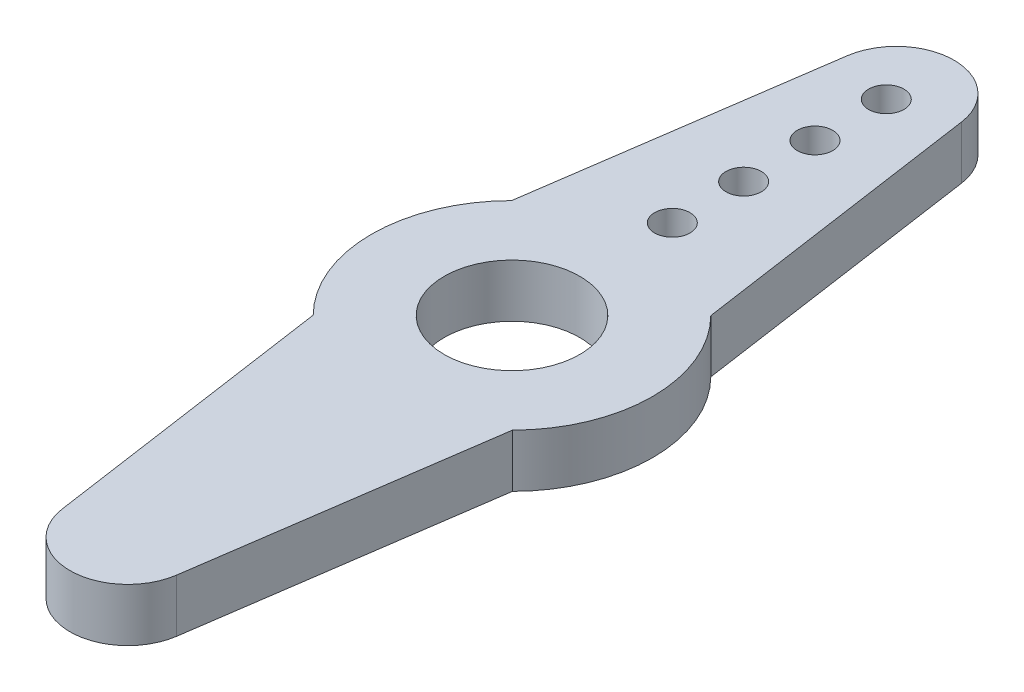
ISO-10303-21;
HEADER;
FILE_DESCRIPTION(('STEP AP214'),'2;1');
FILE_NAME('part.step','',(''),(''),'','','');
FILE_SCHEMA(('AUTOMOTIVE_DESIGN { 1 0 10303 214 1 1 1 1 }'));
ENDSEC;
DATA;
#1=APPLICATION_CONTEXT('core data for automotive mechanical design processes');
#2=APPLICATION_PROTOCOL_DEFINITION('international standard','automotive_design',2000,#1);
#3=PRODUCT_CONTEXT('',#1,'mechanical');
#4=PRODUCT('Part','Part','',(#3));
#5=PRODUCT_RELATED_PRODUCT_CATEGORY('part','',(#4));
#6=PRODUCT_DEFINITION_FORMATION('','',#4);
#7=PRODUCT_DEFINITION_CONTEXT('part definition',#1,'design');
#8=PRODUCT_DEFINITION('design','',#6,#7);
#9=PRODUCT_DEFINITION_SHAPE('','',#8);
#10=(LENGTH_UNIT() NAMED_UNIT(*) SI_UNIT(.MILLI.,.METRE.));
#11=(NAMED_UNIT(*) PLANE_ANGLE_UNIT() SI_UNIT($,.RADIAN.));
#12=(NAMED_UNIT(*) SI_UNIT($,.STERADIAN.) SOLID_ANGLE_UNIT());
#13=UNCERTAINTY_MEASURE_WITH_UNIT(LENGTH_MEASURE(1.E-05),#10,'distance_accuracy_value','');
#14=(GEOMETRIC_REPRESENTATION_CONTEXT(3) GLOBAL_UNCERTAINTY_ASSIGNED_CONTEXT((#13)) GLOBAL_UNIT_ASSIGNED_CONTEXT((#10,
#11,#12)) REPRESENTATION_CONTEXT('',''));
#15=CARTESIAN_POINT('',(0.,0.,0.));
#16=DIRECTION('',(0.,0.,1.));
#17=DIRECTION('',(1.,0.,0.));
#18=AXIS2_PLACEMENT_3D('',#15,#16,#17);
#19=CARTESIAN_POINT('',(0.,2.286,0.));
#20=DIRECTION('',(0.,1.,0.));
#21=DIRECTION('',(0.,0.,1.));
#22=AXIS2_PLACEMENT_3D('',#19,#20,#21);
#23=PLANE('',#22);
#24=CARTESIAN_POINT('',(0.,2.286,-9.9822));
#25=DIRECTION('',(0.,1.,0.));
#26=DIRECTION('',(0.,0.,1.));
#27=AXIS2_PLACEMENT_3D('',#24,#25,#26);
#28=CIRCLE('',#27,0.762);
#29=CARTESIAN_POINT('',(0.,2.286,-9.2202));
#30=VERTEX_POINT('',#29);
#31=EDGE_CURVE('E194',#30,#30,#28,.T.);
#32=ORIENTED_EDGE('',*,*,#31,.F.);
#33=EDGE_LOOP('',(#32));
#34=FACE_BOUND('',#33,.T.);
#35=CARTESIAN_POINT('',(0.,2.286,-16.129));
#36=DIRECTION('',(0.,1.,0.));
#37=DIRECTION('',(0.,0.,1.));
#38=AXIS2_PLACEMENT_3D('',#35,#36,#37);
#39=CIRCLE('',#38,0.762);
#40=CARTESIAN_POINT('',(0.,2.286,-15.367));
#41=VERTEX_POINT('',#40);
#42=EDGE_CURVE('E182',#41,#41,#39,.T.);
#43=ORIENTED_EDGE('',*,*,#42,.F.);
#44=EDGE_LOOP('',(#43));
#45=FACE_BOUND('',#44,.T.);
#46=CARTESIAN_POINT('',(0.,2.286,0.));
#47=DIRECTION('',(0.,1.,0.));
#48=DIRECTION('',(0.,0.,1.));
#49=AXIS2_PLACEMENT_3D('',#46,#47,#48);
#50=CIRCLE('',#49,6.0579);
#51=CARTESIAN_POINT('',(-4.2926,2.286,-4.27454531500135));
#52=VERTEX_POINT('',#51);
#53=CARTESIAN_POINT('',(-4.2926,2.286,4.27454531500135));
#54=VERTEX_POINT('',#53);
#55=EDGE_CURVE('E145',#52,#54,#50,.T.);
#56=ORIENTED_EDGE('',*,*,#55,.T.);
#57=DIRECTION('',(0.142986857260656,0.,0.989724587271995));
#58=VECTOR('',#57,1.);
#59=CARTESIAN_POINT('',(-4.2926,2.286,4.27454531500135));
#60=LINE('',#59,#58);
#61=CARTESIAN_POINT('',(-2.46653130877812,2.286,16.9142040666814));
#62=VERTEX_POINT('',#61);
#63=EDGE_CURVE('E93',#54,#62,#60,.T.);
#64=ORIENTED_EDGE('',*,*,#63,.T.);
#65=CARTESIAN_POINT('',(0.,2.286,16.5578609337405));
#66=DIRECTION('',(0.,1.,0.));
#67=DIRECTION('',(0.,0.,1.));
#68=AXIS2_PLACEMENT_3D('',#65,#66,#67);
#69=CIRCLE('',#68,2.49213906625952);
#70=CARTESIAN_POINT('',(2.46653130877812,2.286,16.9142040666814));
#71=VERTEX_POINT('',#70);
#72=EDGE_CURVE('E160',#62,#71,#69,.T.);
#73=ORIENTED_EDGE('',*,*,#72,.T.);
#74=DIRECTION('',(0.142986857260656,0.,-0.989724587271995));
#75=VECTOR('',#74,1.);
#76=CARTESIAN_POINT('',(4.2926,2.286,4.27454531500135));
#77=LINE('',#76,#75);
#78=CARTESIAN_POINT('',(4.2926,2.286,4.27454531500135));
#79=VERTEX_POINT('',#78);
#80=EDGE_CURVE('E173',#71,#79,#77,.T.);
#81=ORIENTED_EDGE('',*,*,#80,.T.);
#82=CARTESIAN_POINT('',(0.,2.286,0.));
#83=DIRECTION('',(0.,1.,0.));
#84=DIRECTION('',(0.,0.,1.));
#85=AXIS2_PLACEMENT_3D('',#82,#83,#84);
#86=CIRCLE('',#85,6.0579);
#87=CARTESIAN_POINT('',(4.2926,2.286,-4.27454531500135));
#88=VERTEX_POINT('',#87);
#89=EDGE_CURVE('E112',#79,#88,#86,.T.);
#90=ORIENTED_EDGE('',*,*,#89,.T.);
#91=DIRECTION('',(-0.142986857260656,0.,-0.989724587271995));
#92=VECTOR('',#91,1.);
#93=CARTESIAN_POINT('',(4.2926,2.286,-4.27454531500135));
#94=LINE('',#93,#92);
#95=CARTESIAN_POINT('',(2.46653130877812,2.286,-16.9142040666814));
#96=VERTEX_POINT('',#95);
#97=EDGE_CURVE('E106',#88,#96,#94,.T.);
#98=ORIENTED_EDGE('',*,*,#97,.T.);
#99=CARTESIAN_POINT('',(0.,2.286,-16.5578609337405));
#100=DIRECTION('',(0.,1.,0.));
#101=DIRECTION('',(0.,0.,-1.));
#102=AXIS2_PLACEMENT_3D('',#99,#100,#101);
#103=CIRCLE('',#102,2.49213906625952);
#104=CARTESIAN_POINT('',(-2.46653130877812,2.286,-16.9142040666814));
#105=VERTEX_POINT('',#104);
#106=EDGE_CURVE('E110',#96,#105,#103,.T.);
#107=ORIENTED_EDGE('',*,*,#106,.T.);
#108=DIRECTION('',(-0.142986857260656,0.,0.989724587271995));
#109=VECTOR('',#108,1.);
#110=CARTESIAN_POINT('',(-4.2926,2.286,-4.27454531500135));
#111=LINE('',#110,#109);
#112=EDGE_CURVE('E50',#105,#52,#111,.T.);
#113=ORIENTED_EDGE('',*,*,#112,.T.);
#114=EDGE_LOOP('',(#56,#64,#73,#81,#90,#98,#107,#113));
#115=FACE_BOUND('',#114,.T.);
#116=CARTESIAN_POINT('',(0.,2.286,0.));
#117=DIRECTION('',(0.,1.,0.));
#118=DIRECTION('',(0.,0.,1.));
#119=AXIS2_PLACEMENT_3D('',#116,#117,#118);
#120=CIRCLE('',#119,2.921);
#121=CARTESIAN_POINT('',(0.,2.286,2.921));
#122=VERTEX_POINT('',#121);
#123=EDGE_CURVE('E134',#122,#122,#120,.T.);
#124=ORIENTED_EDGE('',*,*,#123,.F.);
#125=EDGE_LOOP('',(#124));
#126=FACE_BOUND('',#125,.T.);
#127=CARTESIAN_POINT('',(0.,2.286,-13.0556));
#128=DIRECTION('',(0.,1.,0.));
#129=DIRECTION('',(0.,0.,1.));
#130=AXIS2_PLACEMENT_3D('',#127,#128,#129);
#131=CIRCLE('',#130,0.762);
#132=CARTESIAN_POINT('',(0.,2.286,-12.2936));
#133=VERTEX_POINT('',#132);
#134=EDGE_CURVE('E188',#133,#133,#131,.T.);
#135=ORIENTED_EDGE('',*,*,#134,.F.);
#136=EDGE_LOOP('',(#135));
#137=FACE_BOUND('',#136,.T.);
#138=CARTESIAN_POINT('',(0.,2.286,-6.9088));
#139=DIRECTION('',(0.,1.,0.));
#140=DIRECTION('',(0.,0.,1.));
#141=AXIS2_PLACEMENT_3D('',#138,#139,#140);
#142=CIRCLE('',#141,0.762);
#143=CARTESIAN_POINT('',(0.,2.286,-6.1468));
#144=VERTEX_POINT('',#143);
#145=EDGE_CURVE('E200',#144,#144,#142,.T.);
#146=ORIENTED_EDGE('',*,*,#145,.F.);
#147=EDGE_LOOP('',(#146));
#148=FACE_BOUND('',#147,.T.);
#149=ADVANCED_FACE('F33',(#34,#45,#115,#126,#137,#148),#23,.T.);
#150=CARTESIAN_POINT('',(0.,0.,0.));
#151=DIRECTION('',(0.,1.,0.));
#152=DIRECTION('',(0.,0.,1.));
#153=AXIS2_PLACEMENT_3D('',#150,#151,#152);
#154=PLANE('',#153);
#155=CARTESIAN_POINT('',(0.,0.,0.));
#156=DIRECTION('',(0.,1.,0.));
#157=DIRECTION('',(0.,0.,1.));
#158=AXIS2_PLACEMENT_3D('',#155,#156,#157);
#159=CIRCLE('',#158,6.0579);
#160=CARTESIAN_POINT('',(-4.2926,0.,-4.27454531500135));
#161=VERTEX_POINT('',#160);
#162=CARTESIAN_POINT('',(-4.2926,0.,4.27454531500135));
#163=VERTEX_POINT('',#162);
#164=EDGE_CURVE('E130',#161,#163,#159,.T.);
#165=ORIENTED_EDGE('',*,*,#164,.F.);
#166=DIRECTION('',(-0.142986857260656,0.,0.989724587271995));
#167=VECTOR('',#166,1.);
#168=CARTESIAN_POINT('',(-4.2926,0.,-4.27454531500135));
#169=LINE('',#168,#167);
#170=CARTESIAN_POINT('',(-2.46653130877812,0.,-16.9142040666814));
#171=VERTEX_POINT('',#170);
#172=EDGE_CURVE('E85',#171,#161,#169,.T.);
#173=ORIENTED_EDGE('',*,*,#172,.F.);
#174=CARTESIAN_POINT('',(0.,0.,-16.5578609337405));
#175=DIRECTION('',(0.,1.,0.));
#176=DIRECTION('',(0.,0.,-1.));
#177=AXIS2_PLACEMENT_3D('',#174,#175,#176);
#178=CIRCLE('',#177,2.49213906625952);
#179=CARTESIAN_POINT('',(2.46653130877812,0.,-16.9142040666814));
#180=VERTEX_POINT('',#179);
#181=EDGE_CURVE('E79',#180,#171,#178,.T.);
#182=ORIENTED_EDGE('',*,*,#181,.F.);
#183=DIRECTION('',(-0.142986857260656,0.,-0.989724587271995));
#184=VECTOR('',#183,1.);
#185=CARTESIAN_POINT('',(4.2926,0.,-4.27454531500135));
#186=LINE('',#185,#184);
#187=CARTESIAN_POINT('',(4.2926,0.,-4.27454531500135));
#188=VERTEX_POINT('',#187);
#189=EDGE_CURVE('E120',#188,#180,#186,.T.);
#190=ORIENTED_EDGE('',*,*,#189,.F.);
#191=CARTESIAN_POINT('',(0.,0.,0.));
#192=DIRECTION('',(0.,1.,0.));
#193=DIRECTION('',(0.,0.,1.));
#194=AXIS2_PLACEMENT_3D('',#191,#192,#193);
#195=CIRCLE('',#194,6.0579);
#196=CARTESIAN_POINT('',(4.2926,0.,4.27454531500135));
#197=VERTEX_POINT('',#196);
#198=EDGE_CURVE('E140',#197,#188,#195,.T.);
#199=ORIENTED_EDGE('',*,*,#198,.F.);
#200=DIRECTION('',(0.142986857260656,0.,-0.989724587271995));
#201=VECTOR('',#200,1.);
#202=CARTESIAN_POINT('',(4.2926,0.,4.27454531500135));
#203=LINE('',#202,#201);
#204=CARTESIAN_POINT('',(2.46653130877812,0.,16.9142040666814));
#205=VERTEX_POINT('',#204);
#206=EDGE_CURVE('E138',#205,#197,#203,.T.);
#207=ORIENTED_EDGE('',*,*,#206,.F.);
#208=CARTESIAN_POINT('',(0.,0.,16.5578609337405));
#209=DIRECTION('',(0.,1.,0.));
#210=DIRECTION('',(0.,0.,1.));
#211=AXIS2_PLACEMENT_3D('',#208,#209,#210);
#212=CIRCLE('',#211,2.49213906625952);
#213=CARTESIAN_POINT('',(-2.46653130877812,0.,16.9142040666814));
#214=VERTEX_POINT('',#213);
#215=EDGE_CURVE('E136',#214,#205,#212,.T.);
#216=ORIENTED_EDGE('',*,*,#215,.F.);
#217=DIRECTION('',(0.142986857260656,0.,0.989724587271995));
#218=VECTOR('',#217,1.);
#219=CARTESIAN_POINT('',(-4.2926,0.,4.27454531500135));
#220=LINE('',#219,#218);
#221=EDGE_CURVE('E133',#163,#214,#220,.T.);
#222=ORIENTED_EDGE('',*,*,#221,.F.);
#223=EDGE_LOOP('',(#165,#173,#182,#190,#199,#207,#216,#222));
#224=FACE_BOUND('',#223,.T.);
#225=CARTESIAN_POINT('',(0.,0.,0.));
#226=DIRECTION('',(0.,1.,0.));
#227=DIRECTION('',(0.,0.,1.));
#228=AXIS2_PLACEMENT_3D('',#225,#226,#227);
#229=CIRCLE('',#228,2.921);
#230=CARTESIAN_POINT('',(0.,0.,2.921));
#231=VERTEX_POINT('',#230);
#232=EDGE_CURVE('E179',#231,#231,#229,.T.);
#233=ORIENTED_EDGE('',*,*,#232,.T.);
#234=EDGE_LOOP('',(#233));
#235=FACE_BOUND('',#234,.T.);
#236=CARTESIAN_POINT('',(0.,0.,-16.129));
#237=DIRECTION('',(0.,1.,0.));
#238=DIRECTION('',(0.,0.,1.));
#239=AXIS2_PLACEMENT_3D('',#236,#237,#238);
#240=CIRCLE('',#239,0.762);
#241=CARTESIAN_POINT('',(0.,0.,-15.367));
#242=VERTEX_POINT('',#241);
#243=EDGE_CURVE('E185',#242,#242,#240,.T.);
#244=ORIENTED_EDGE('',*,*,#243,.T.);
#245=EDGE_LOOP('',(#244));
#246=FACE_BOUND('',#245,.T.);
#247=CARTESIAN_POINT('',(0.,0.,-13.0556));
#248=DIRECTION('',(0.,1.,0.));
#249=DIRECTION('',(0.,0.,1.));
#250=AXIS2_PLACEMENT_3D('',#247,#248,#249);
#251=CIRCLE('',#250,0.762);
#252=CARTESIAN_POINT('',(0.,0.,-12.2936));
#253=VERTEX_POINT('',#252);
#254=EDGE_CURVE('E191',#253,#253,#251,.T.);
#255=ORIENTED_EDGE('',*,*,#254,.T.);
#256=EDGE_LOOP('',(#255));
#257=FACE_BOUND('',#256,.T.);
#258=CARTESIAN_POINT('',(0.,0.,-9.9822));
#259=DIRECTION('',(0.,1.,0.));
#260=DIRECTION('',(0.,0.,1.));
#261=AXIS2_PLACEMENT_3D('',#258,#259,#260);
#262=CIRCLE('',#261,0.762);
#263=CARTESIAN_POINT('',(0.,0.,-9.2202));
#264=VERTEX_POINT('',#263);
#265=EDGE_CURVE('E197',#264,#264,#262,.T.);
#266=ORIENTED_EDGE('',*,*,#265,.T.);
#267=EDGE_LOOP('',(#266));
#268=FACE_BOUND('',#267,.T.);
#269=CARTESIAN_POINT('',(0.,0.,-6.9088));
#270=DIRECTION('',(0.,1.,0.));
#271=DIRECTION('',(0.,0.,1.));
#272=AXIS2_PLACEMENT_3D('',#269,#270,#271);
#273=CIRCLE('',#272,0.762);
#274=CARTESIAN_POINT('',(0.,0.,-6.1468));
#275=VERTEX_POINT('',#274);
#276=EDGE_CURVE('E203',#275,#275,#273,.T.);
#277=ORIENTED_EDGE('',*,*,#276,.T.);
#278=EDGE_LOOP('',(#277));
#279=FACE_BOUND('',#278,.T.);
#280=ADVANCED_FACE('F164',(#224,#235,#246,#257,#268,#279),#154,.F.);
#281=CARTESIAN_POINT('',(0.,2.286,0.));
#282=DIRECTION('',(0.,-1.,0.));
#283=DIRECTION('',(0.,0.,-1.));
#284=AXIS2_PLACEMENT_3D('',#281,#282,#283);
#285=CYLINDRICAL_SURFACE('',#284,6.0579);
#286=ORIENTED_EDGE('',*,*,#164,.T.);
#287=DIRECTION('',(0.,-1.,0.));
#288=VECTOR('',#287,1.);
#289=CARTESIAN_POINT('',(-4.2926,2.286,4.27454531500135));
#290=LINE('',#289,#288);
#291=EDGE_CURVE('E11',#54,#163,#290,.T.);
#292=ORIENTED_EDGE('',*,*,#291,.F.);
#293=ORIENTED_EDGE('',*,*,#55,.F.);
#294=DIRECTION('',(0.,-1.,0.));
#295=VECTOR('',#294,1.);
#296=CARTESIAN_POINT('',(-4.2926,2.286,-4.27454531500135));
#297=LINE('',#296,#295);
#298=EDGE_CURVE('E126',#52,#161,#297,.T.);
#299=ORIENTED_EDGE('',*,*,#298,.T.);
#300=EDGE_LOOP('',(#286,#292,#293,#299));
#301=FACE_BOUND('',#300,.T.);
#302=ADVANCED_FACE('F35',(#301),#285,.T.);
#303=CARTESIAN_POINT('',(-4.2926,2.286,4.27454531500135));
#304=DIRECTION('',(0.989724587271995,0.,-0.142986857260656));
#305=DIRECTION('',(-0.142986857260656,0.,-0.989724587271995));
#306=AXIS2_PLACEMENT_3D('',#303,#304,#305);
#307=PLANE('',#306);
#308=ORIENTED_EDGE('',*,*,#221,.T.);
#309=DIRECTION('',(0.,-1.,0.));
#310=VECTOR('',#309,1.);
#311=CARTESIAN_POINT('',(-2.46653130877812,2.286,16.9142040666814));
#312=LINE('',#311,#310);
#313=EDGE_CURVE('E42',#62,#214,#312,.T.);
#314=ORIENTED_EDGE('',*,*,#313,.F.);
#315=ORIENTED_EDGE('',*,*,#63,.F.);
#316=ORIENTED_EDGE('',*,*,#291,.T.);
#317=EDGE_LOOP('',(#308,#314,#315,#316));
#318=FACE_BOUND('',#317,.T.);
#319=ADVANCED_FACE('F237',(#318),#307,.F.);
#320=CARTESIAN_POINT('',(0.,2.286,16.5578609337405));
#321=DIRECTION('',(0.,-1.,0.));
#322=DIRECTION('',(0.,0.,-1.));
#323=AXIS2_PLACEMENT_3D('',#320,#321,#322);
#324=CYLINDRICAL_SURFACE('',#323,2.49213906625952);
#325=ORIENTED_EDGE('',*,*,#215,.T.);
#326=DIRECTION('',(0.,-1.,0.));
#327=VECTOR('',#326,1.);
#328=CARTESIAN_POINT('',(2.46653130877812,2.286,16.9142040666814));
#329=LINE('',#328,#327);
#330=EDGE_CURVE('E152',#71,#205,#329,.T.);
#331=ORIENTED_EDGE('',*,*,#330,.F.);
#332=ORIENTED_EDGE('',*,*,#72,.F.);
#333=ORIENTED_EDGE('',*,*,#313,.T.);
#334=EDGE_LOOP('',(#325,#331,#332,#333));
#335=FACE_BOUND('',#334,.T.);
#336=ADVANCED_FACE('F158',(#335),#324,.T.);
#337=CARTESIAN_POINT('',(4.2926,2.286,4.27454531500135));
#338=DIRECTION('',(-0.989724587271995,0.,-0.142986857260656));
#339=DIRECTION('',(-0.142986857260656,0.,0.989724587271995));
#340=AXIS2_PLACEMENT_3D('',#337,#338,#339);
#341=PLANE('',#340);
#342=ORIENTED_EDGE('',*,*,#206,.T.);
#343=DIRECTION('',(0.,-1.,0.));
#344=VECTOR('',#343,1.);
#345=CARTESIAN_POINT('',(4.2926,2.286,4.27454531500135));
#346=LINE('',#345,#344);
#347=EDGE_CURVE('E149',#79,#197,#346,.T.);
#348=ORIENTED_EDGE('',*,*,#347,.F.);
#349=ORIENTED_EDGE('',*,*,#80,.F.);
#350=ORIENTED_EDGE('',*,*,#330,.T.);
#351=EDGE_LOOP('',(#342,#348,#349,#350));
#352=FACE_BOUND('',#351,.T.);
#353=ADVANCED_FACE('F169',(#352),#341,.F.);
#354=CARTESIAN_POINT('',(0.,2.286,0.));
#355=DIRECTION('',(0.,-1.,0.));
#356=DIRECTION('',(0.,0.,-1.));
#357=AXIS2_PLACEMENT_3D('',#354,#355,#356);
#358=CYLINDRICAL_SURFACE('',#357,6.0579);
#359=ORIENTED_EDGE('',*,*,#198,.T.);
#360=DIRECTION('',(0.,-1.,0.));
#361=VECTOR('',#360,1.);
#362=CARTESIAN_POINT('',(4.2926,2.286,-4.27454531500135));
#363=LINE('',#362,#361);
#364=EDGE_CURVE('E121',#88,#188,#363,.T.);
#365=ORIENTED_EDGE('',*,*,#364,.F.);
#366=ORIENTED_EDGE('',*,*,#89,.F.);
#367=ORIENTED_EDGE('',*,*,#347,.T.);
#368=EDGE_LOOP('',(#359,#365,#366,#367));
#369=FACE_BOUND('',#368,.T.);
#370=ADVANCED_FACE('F172',(#369),#358,.T.);
#371=CARTESIAN_POINT('',(4.2926,2.286,-4.27454531500135));
#372=DIRECTION('',(-0.989724587271995,0.,0.142986857260656));
#373=DIRECTION('',(0.142986857260656,0.,0.989724587271995));
#374=AXIS2_PLACEMENT_3D('',#371,#372,#373);
#375=PLANE('',#374);
#376=ORIENTED_EDGE('',*,*,#189,.T.);
#377=DIRECTION('',(0.,-1.,0.));
#378=VECTOR('',#377,1.);
#379=CARTESIAN_POINT('',(2.46653130877812,2.286,-16.9142040666814));
#380=LINE('',#379,#378);
#381=EDGE_CURVE('E117',#96,#180,#380,.T.);
#382=ORIENTED_EDGE('',*,*,#381,.F.);
#383=ORIENTED_EDGE('',*,*,#97,.F.);
#384=ORIENTED_EDGE('',*,*,#364,.T.);
#385=EDGE_LOOP('',(#376,#382,#383,#384));
#386=FACE_BOUND('',#385,.T.);
#387=ADVANCED_FACE('F118',(#386),#375,.F.);
#388=CARTESIAN_POINT('',(0.,2.286,-16.5578609337405));
#389=DIRECTION('',(0.,-1.,0.));
#390=DIRECTION('',(0.,0.,-1.));
#391=AXIS2_PLACEMENT_3D('',#388,#389,#390);
#392=CYLINDRICAL_SURFACE('',#391,2.49213906625952);
#393=ORIENTED_EDGE('',*,*,#181,.T.);
#394=DIRECTION('',(0.,-1.,0.));
#395=VECTOR('',#394,1.);
#396=CARTESIAN_POINT('',(-2.46653130877812,2.286,-16.9142040666814));
#397=LINE('',#396,#395);
#398=EDGE_CURVE('E122',#105,#171,#397,.T.);
#399=ORIENTED_EDGE('',*,*,#398,.F.);
#400=ORIENTED_EDGE('',*,*,#106,.F.);
#401=ORIENTED_EDGE('',*,*,#381,.T.);
#402=EDGE_LOOP('',(#393,#399,#400,#401));
#403=FACE_BOUND('',#402,.T.);
#404=ADVANCED_FACE('F124',(#403),#392,.T.);
#405=CARTESIAN_POINT('',(-4.2926,2.286,-4.27454531500135));
#406=DIRECTION('',(0.989724587271995,0.,0.142986857260656));
#407=DIRECTION('',(0.142986857260656,0.,-0.989724587271995));
#408=AXIS2_PLACEMENT_3D('',#405,#406,#407);
#409=PLANE('',#408);
#410=ORIENTED_EDGE('',*,*,#172,.T.);
#411=ORIENTED_EDGE('',*,*,#298,.F.);
#412=ORIENTED_EDGE('',*,*,#112,.F.);
#413=ORIENTED_EDGE('',*,*,#398,.T.);
#414=EDGE_LOOP('',(#410,#411,#412,#413));
#415=FACE_BOUND('',#414,.T.);
#416=ADVANCED_FACE('F225',(#415),#409,.F.);
#417=CARTESIAN_POINT('',(0.,2.286,0.));
#418=DIRECTION('',(0.,-1.,0.));
#419=DIRECTION('',(0.,0.,-1.));
#420=AXIS2_PLACEMENT_3D('',#417,#418,#419);
#421=CYLINDRICAL_SURFACE('',#420,2.921);
#422=ORIENTED_EDGE('',*,*,#123,.T.);
#423=EDGE_LOOP('',(#422));
#424=FACE_BOUND('',#423,.T.);
#425=ORIENTED_EDGE('',*,*,#232,.F.);
#426=EDGE_LOOP('',(#425));
#427=FACE_BOUND('',#426,.T.);
#428=ADVANCED_FACE('F222',(#424,#427),#421,.F.);
#429=CARTESIAN_POINT('',(0.,2.286,-16.129));
#430=DIRECTION('',(0.,-1.,0.));
#431=DIRECTION('',(0.,0.,-1.));
#432=AXIS2_PLACEMENT_3D('',#429,#430,#431);
#433=CYLINDRICAL_SURFACE('',#432,0.762);
#434=ORIENTED_EDGE('',*,*,#42,.T.);
#435=EDGE_LOOP('',(#434));
#436=FACE_BOUND('',#435,.T.);
#437=ORIENTED_EDGE('',*,*,#243,.F.);
#438=EDGE_LOOP('',(#437));
#439=FACE_BOUND('',#438,.T.);
#440=ADVANCED_FACE('F301',(#436,#439),#433,.F.);
#441=CARTESIAN_POINT('',(0.,2.286,-13.0556));
#442=DIRECTION('',(0.,-1.,0.));
#443=DIRECTION('',(0.,0.,-1.));
#444=AXIS2_PLACEMENT_3D('',#441,#442,#443);
#445=CYLINDRICAL_SURFACE('',#444,0.762);
#446=ORIENTED_EDGE('',*,*,#134,.T.);
#447=EDGE_LOOP('',(#446));
#448=FACE_BOUND('',#447,.T.);
#449=ORIENTED_EDGE('',*,*,#254,.F.);
#450=EDGE_LOOP('',(#449));
#451=FACE_BOUND('',#450,.T.);
#452=ADVANCED_FACE('F309',(#448,#451),#445,.F.);
#453=CARTESIAN_POINT('',(0.,2.286,-9.9822));
#454=DIRECTION('',(0.,-1.,0.));
#455=DIRECTION('',(0.,0.,-1.));
#456=AXIS2_PLACEMENT_3D('',#453,#454,#455);
#457=CYLINDRICAL_SURFACE('',#456,0.762);
#458=ORIENTED_EDGE('',*,*,#31,.T.);
#459=EDGE_LOOP('',(#458));
#460=FACE_BOUND('',#459,.T.);
#461=ORIENTED_EDGE('',*,*,#265,.F.);
#462=EDGE_LOOP('',(#461));
#463=FACE_BOUND('',#462,.T.);
#464=ADVANCED_FACE('F317',(#460,#463),#457,.F.);
#465=CARTESIAN_POINT('',(0.,2.286,-6.9088));
#466=DIRECTION('',(0.,-1.,0.));
#467=DIRECTION('',(0.,0.,-1.));
#468=AXIS2_PLACEMENT_3D('',#465,#466,#467);
#469=CYLINDRICAL_SURFACE('',#468,0.762);
#470=ORIENTED_EDGE('',*,*,#145,.T.);
#471=EDGE_LOOP('',(#470));
#472=FACE_BOUND('',#471,.T.);
#473=ORIENTED_EDGE('',*,*,#276,.F.);
#474=EDGE_LOOP('',(#473));
#475=FACE_BOUND('',#474,.T.);
#476=ADVANCED_FACE('F209',(#472,#475),#469,.F.);
#477=CLOSED_SHELL('',(#149,#280,#302,#319,#336,#353,#370,#387,#404,#416,#428,#440,#452,#464,#476));
#478=MANIFOLD_SOLID_BREP('B2',#477);
#479=ADVANCED_BREP_SHAPE_REPRESENTATION('',(#18,#478),#14);
#480=SHAPE_DEFINITION_REPRESENTATION(#9,#479);
ENDSEC;
END-ISO-10303-21;
